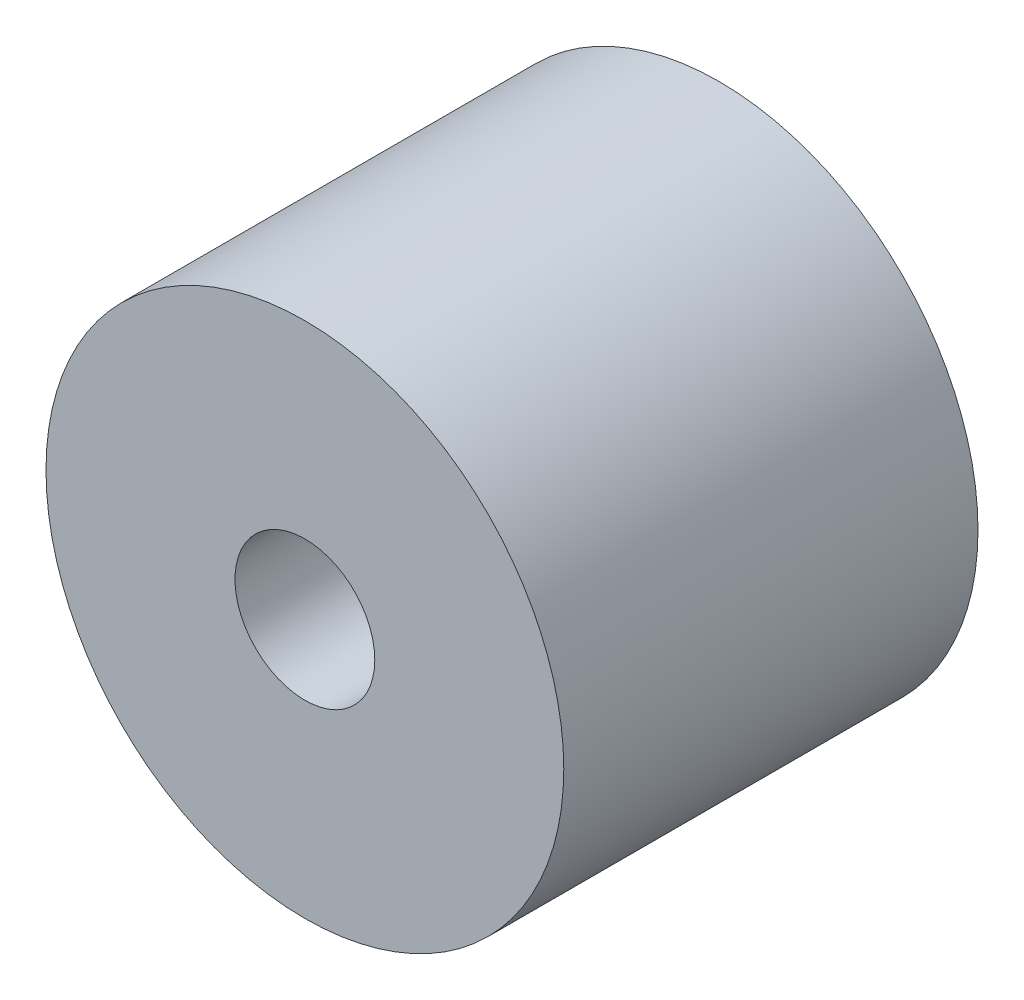
ISO-10303-21;
HEADER;
FILE_DESCRIPTION(('STEP AP214'),'2;1');
FILE_NAME('part.step','',(''),(''),'','','');
FILE_SCHEMA(('AUTOMOTIVE_DESIGN { 1 0 10303 214 1 1 1 1 }'));
ENDSEC;
DATA;
#1=APPLICATION_CONTEXT('core data for automotive mechanical design processes');
#2=APPLICATION_PROTOCOL_DEFINITION('international standard','automotive_design',2000,#1);
#3=PRODUCT_CONTEXT('',#1,'mechanical');
#4=PRODUCT('Part','Part','',(#3));
#5=PRODUCT_RELATED_PRODUCT_CATEGORY('part','',(#4));
#6=PRODUCT_DEFINITION_FORMATION('','',#4);
#7=PRODUCT_DEFINITION_CONTEXT('part definition',#1,'design');
#8=PRODUCT_DEFINITION('design','',#6,#7);
#9=PRODUCT_DEFINITION_SHAPE('','',#8);
#10=(LENGTH_UNIT() NAMED_UNIT(*) SI_UNIT(.MILLI.,.METRE.));
#11=(NAMED_UNIT(*) PLANE_ANGLE_UNIT() SI_UNIT($,.RADIAN.));
#12=(NAMED_UNIT(*) SI_UNIT($,.STERADIAN.) SOLID_ANGLE_UNIT());
#13=UNCERTAINTY_MEASURE_WITH_UNIT(LENGTH_MEASURE(1.E-05),#10,'distance_accuracy_value','');
#14=(GEOMETRIC_REPRESENTATION_CONTEXT(3) GLOBAL_UNCERTAINTY_ASSIGNED_CONTEXT((#13)) GLOBAL_UNIT_ASSIGNED_CONTEXT((#10,
#11,#12)) REPRESENTATION_CONTEXT('',''));
#15=CARTESIAN_POINT('',(0.,0.,0.));
#16=DIRECTION('',(0.,0.,1.));
#17=DIRECTION('',(1.,0.,0.));
#18=AXIS2_PLACEMENT_3D('',#15,#16,#17);
#19=CARTESIAN_POINT('',(0.,0.,-10.16));
#20=DIRECTION('',(0.,0.,1.));
#21=DIRECTION('',(1.,0.,0.));
#22=AXIS2_PLACEMENT_3D('',#19,#20,#21);
#23=CYLINDRICAL_SURFACE('',#22,6.35);
#24=CARTESIAN_POINT('',(0.,0.,-10.16));
#25=DIRECTION('',(0.,0.,1.));
#26=DIRECTION('',(1.,0.,0.));
#27=AXIS2_PLACEMENT_3D('',#24,#25,#26);
#28=CIRCLE('',#27,6.35);
#29=CARTESIAN_POINT('',(6.35,0.,-10.16));
#30=VERTEX_POINT('',#29);
#31=EDGE_CURVE('E10',#30,#30,#28,.T.);
#32=ORIENTED_EDGE('',*,*,#31,.T.);
#33=EDGE_LOOP('',(#32));
#34=FACE_BOUND('',#33,.T.);
#35=CARTESIAN_POINT('',(0.,0.,0.));
#36=DIRECTION('',(0.,0.,1.));
#37=DIRECTION('',(1.,0.,0.));
#38=AXIS2_PLACEMENT_3D('',#35,#36,#37);
#39=CIRCLE('',#38,6.35);
#40=CARTESIAN_POINT('',(6.35,0.,0.));
#41=VERTEX_POINT('',#40);
#42=EDGE_CURVE('E44',#41,#41,#39,.T.);
#43=ORIENTED_EDGE('',*,*,#42,.F.);
#44=EDGE_LOOP('',(#43));
#45=FACE_BOUND('',#44,.T.);
#46=ADVANCED_FACE('F41',(#34,#45),#23,.T.);
#47=CARTESIAN_POINT('',(0.,0.,-10.16));
#48=DIRECTION('',(0.,0.,1.));
#49=DIRECTION('',(1.,0.,0.));
#50=AXIS2_PLACEMENT_3D('',#47,#48,#49);
#51=PLANE('',#50);
#52=CARTESIAN_POINT('',(0.,0.,-10.16));
#53=DIRECTION('',(0.,0.,1.));
#54=DIRECTION('',(1.,0.,0.));
#55=AXIS2_PLACEMENT_3D('',#52,#53,#54);
#56=CIRCLE('',#55,1.7145);
#57=CARTESIAN_POINT('',(1.7145,0.,-10.16));
#58=VERTEX_POINT('',#57);
#59=EDGE_CURVE('E55',#58,#58,#56,.T.);
#60=ORIENTED_EDGE('',*,*,#59,.T.);
#61=EDGE_LOOP('',(#60));
#62=FACE_BOUND('',#61,.T.);
#63=ORIENTED_EDGE('',*,*,#31,.F.);
#64=EDGE_LOOP('',(#63));
#65=FACE_BOUND('',#64,.T.);
#66=ADVANCED_FACE('F72',(#62,#65),#51,.F.);
#67=CARTESIAN_POINT('',(0.,0.,0.));
#68=DIRECTION('',(0.,0.,1.));
#69=DIRECTION('',(1.,0.,0.));
#70=AXIS2_PLACEMENT_3D('',#67,#68,#69);
#71=PLANE('',#70);
#72=CARTESIAN_POINT('',(0.,0.,0.));
#73=DIRECTION('',(0.,0.,1.));
#74=DIRECTION('',(1.,0.,0.));
#75=AXIS2_PLACEMENT_3D('',#72,#73,#74);
#76=CIRCLE('',#75,1.7145);
#77=CARTESIAN_POINT('',(1.7145,0.,0.));
#78=VERTEX_POINT('',#77);
#79=EDGE_CURVE('E60',#78,#78,#76,.T.);
#80=ORIENTED_EDGE('',*,*,#79,.F.);
#81=EDGE_LOOP('',(#80));
#82=FACE_BOUND('',#81,.T.);
#83=ORIENTED_EDGE('',*,*,#42,.T.);
#84=EDGE_LOOP('',(#83));
#85=FACE_BOUND('',#84,.T.);
#86=ADVANCED_FACE('F69',(#82,#85),#71,.T.);
#87=CARTESIAN_POINT('',(0.,0.,0.));
#88=DIRECTION('',(0.,0.,1.));
#89=DIRECTION('',(1.,0.,0.));
#90=AXIS2_PLACEMENT_3D('',#87,#88,#89);
#91=CYLINDRICAL_SURFACE('',#90,1.7145);
#92=ORIENTED_EDGE('',*,*,#59,.F.);
#93=EDGE_LOOP('',(#92));
#94=FACE_BOUND('',#93,.T.);
#95=ORIENTED_EDGE('',*,*,#79,.T.);
#96=EDGE_LOOP('',(#95));
#97=FACE_BOUND('',#96,.T.);
#98=ADVANCED_FACE('F67',(#94,#97),#91,.F.);
#99=CLOSED_SHELL('',(#46,#66,#86,#98));
#100=MANIFOLD_SOLID_BREP('B2',#99);
#101=ADVANCED_BREP_SHAPE_REPRESENTATION('',(#18,#100),#14);
#102=SHAPE_DEFINITION_REPRESENTATION(#9,#101);
ENDSEC;
END-ISO-10303-21;
